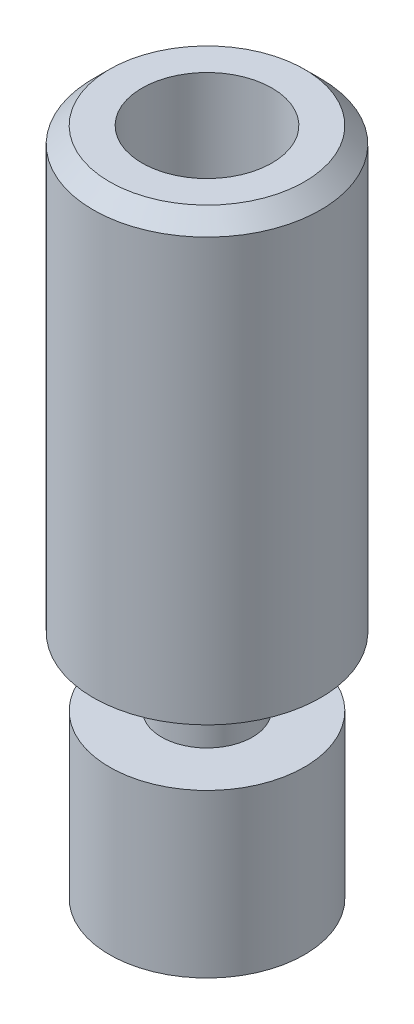
ISO-10303-21;
HEADER;
FILE_DESCRIPTION(('STEP AP214'),'2;1');
FILE_NAME('part.step','',(''),(''),'','','');
FILE_SCHEMA(('AUTOMOTIVE_DESIGN { 1 0 10303 214 1 1 1 1 }'));
ENDSEC;
DATA;
#1=APPLICATION_CONTEXT('core data for automotive mechanical design processes');
#2=APPLICATION_PROTOCOL_DEFINITION('international standard','automotive_design',2000,#1);
#3=PRODUCT_CONTEXT('',#1,'mechanical');
#4=PRODUCT('Part','Part','',(#3));
#5=PRODUCT_RELATED_PRODUCT_CATEGORY('part','',(#4));
#6=PRODUCT_DEFINITION_FORMATION('','',#4);
#7=PRODUCT_DEFINITION_CONTEXT('part definition',#1,'design');
#8=PRODUCT_DEFINITION('design','',#6,#7);
#9=PRODUCT_DEFINITION_SHAPE('','',#8);
#10=(LENGTH_UNIT() NAMED_UNIT(*) SI_UNIT(.MILLI.,.METRE.));
#11=(NAMED_UNIT(*) PLANE_ANGLE_UNIT() SI_UNIT($,.RADIAN.));
#12=(NAMED_UNIT(*) SI_UNIT($,.STERADIAN.) SOLID_ANGLE_UNIT());
#13=UNCERTAINTY_MEASURE_WITH_UNIT(LENGTH_MEASURE(1.E-05),#10,'distance_accuracy_value','');
#14=(GEOMETRIC_REPRESENTATION_CONTEXT(3) GLOBAL_UNCERTAINTY_ASSIGNED_CONTEXT((#13)) GLOBAL_UNIT_ASSIGNED_CONTEXT((#10,
#11,#12)) REPRESENTATION_CONTEXT('',''));
#15=CARTESIAN_POINT('',(0.,0.,0.));
#16=DIRECTION('',(0.,0.,1.));
#17=DIRECTION('',(1.,0.,0.));
#18=AXIS2_PLACEMENT_3D('',#15,#16,#17);
#19=CARTESIAN_POINT('',(0.,-10.3,0.));
#20=DIRECTION('',(0.,-1.,0.));
#21=DIRECTION('',(0.,0.,-1.));
#22=AXIS2_PLACEMENT_3D('',#19,#20,#21);
#23=CYLINDRICAL_SURFACE('',#22,3.);
#24=CARTESIAN_POINT('',(0.,-5.3,0.));
#25=DIRECTION('',(0.,-1.,0.));
#26=DIRECTION('',(0.,0.,-1.));
#27=AXIS2_PLACEMENT_3D('',#24,#25,#26);
#28=CIRCLE('',#27,3.);
#29=CARTESIAN_POINT('',(0.,-5.3,-3.));
#30=VERTEX_POINT('',#29);
#31=EDGE_CURVE('E42',#30,#30,#28,.T.);
#32=ORIENTED_EDGE('',*,*,#31,.T.);
#33=EDGE_LOOP('',(#32));
#34=FACE_BOUND('',#33,.T.);
#35=CARTESIAN_POINT('',(0.,-10.3,0.));
#36=DIRECTION('',(0.,-1.,0.));
#37=DIRECTION('',(0.,0.,-1.));
#38=AXIS2_PLACEMENT_3D('',#35,#36,#37);
#39=CIRCLE('',#38,3.);
#40=CARTESIAN_POINT('',(0.,-10.3,-3.));
#41=VERTEX_POINT('',#40);
#42=EDGE_CURVE('E69',#41,#41,#39,.T.);
#43=ORIENTED_EDGE('',*,*,#42,.F.);
#44=EDGE_LOOP('',(#43));
#45=FACE_BOUND('',#44,.T.);
#46=ADVANCED_FACE('F31',(#34,#45),#23,.T.);
#47=CARTESIAN_POINT('',(3.,-5.3,0.));
#48=DIRECTION('',(0.,1.,0.));
#49=DIRECTION('',(0.,0.,1.));
#50=AXIS2_PLACEMENT_3D('',#47,#48,#49);
#51=PLANE('',#50);
#52=CARTESIAN_POINT('',(0.,-5.3,0.));
#53=DIRECTION('',(0.,-1.,0.));
#54=DIRECTION('',(0.,0.,-1.));
#55=AXIS2_PLACEMENT_3D('',#52,#53,#54);
#56=CIRCLE('',#55,1.4);
#57=CARTESIAN_POINT('',(0.,-5.3,-1.4));
#58=VERTEX_POINT('',#57);
#59=EDGE_CURVE('E46',#58,#58,#56,.T.);
#60=ORIENTED_EDGE('',*,*,#59,.T.);
#61=EDGE_LOOP('',(#60));
#62=FACE_BOUND('',#61,.T.);
#63=ORIENTED_EDGE('',*,*,#31,.F.);
#64=EDGE_LOOP('',(#63));
#65=FACE_BOUND('',#64,.T.);
#66=ADVANCED_FACE('F77',(#62,#65),#51,.T.);
#67=CARTESIAN_POINT('',(0.,-10.3,0.));
#68=DIRECTION('',(0.,-1.,0.));
#69=DIRECTION('',(0.,0.,-1.));
#70=AXIS2_PLACEMENT_3D('',#67,#68,#69);
#71=CYLINDRICAL_SURFACE('',#70,1.4);
#72=CARTESIAN_POINT('',(0.,-3.2,0.));
#73=DIRECTION('',(0.,-1.,0.));
#74=DIRECTION('',(0.,0.,-1.));
#75=AXIS2_PLACEMENT_3D('',#72,#73,#74);
#76=CIRCLE('',#75,1.4);
#77=CARTESIAN_POINT('',(0.,-3.2,-1.4));
#78=VERTEX_POINT('',#77);
#79=EDGE_CURVE('E51',#78,#78,#76,.T.);
#80=ORIENTED_EDGE('',*,*,#79,.T.);
#81=EDGE_LOOP('',(#80));
#82=FACE_BOUND('',#81,.T.);
#83=ORIENTED_EDGE('',*,*,#59,.F.);
#84=EDGE_LOOP('',(#83));
#85=FACE_BOUND('',#84,.T.);
#86=ADVANCED_FACE('F82',(#82,#85),#71,.T.);
#87=CARTESIAN_POINT('',(1.4,-3.2,0.));
#88=DIRECTION('',(0.,-1.,0.));
#89=DIRECTION('',(0.,0.,-1.));
#90=AXIS2_PLACEMENT_3D('',#87,#88,#89);
#91=PLANE('',#90);
#92=CARTESIAN_POINT('',(0.,-3.2,0.));
#93=DIRECTION('',(0.,-1.,0.));
#94=DIRECTION('',(0.,0.,-1.));
#95=AXIS2_PLACEMENT_3D('',#92,#93,#94);
#96=CIRCLE('',#95,3.5);
#97=CARTESIAN_POINT('',(0.,-3.2,-3.5));
#98=VERTEX_POINT('',#97);
#99=EDGE_CURVE('E54',#98,#98,#96,.T.);
#100=ORIENTED_EDGE('',*,*,#99,.T.);
#101=EDGE_LOOP('',(#100));
#102=FACE_BOUND('',#101,.T.);
#103=ORIENTED_EDGE('',*,*,#79,.F.);
#104=EDGE_LOOP('',(#103));
#105=FACE_BOUND('',#104,.T.);
#106=ADVANCED_FACE('F88',(#102,#105),#91,.T.);
#107=CARTESIAN_POINT('',(0.,-10.3,0.));
#108=DIRECTION('',(0.,-1.,0.));
#109=DIRECTION('',(0.,0.,-1.));
#110=AXIS2_PLACEMENT_3D('',#107,#108,#109);
#111=CYLINDRICAL_SURFACE('',#110,3.5);
#112=CARTESIAN_POINT('',(0.,9.79999999999999,0.));
#113=DIRECTION('',(0.,1.,0.));
#114=DIRECTION('',(0.,0.,1.));
#115=AXIS2_PLACEMENT_3D('',#112,#113,#114);
#116=CIRCLE('',#115,3.5);
#117=CARTESIAN_POINT('',(0.,9.79999999999999,3.5));
#118=VERTEX_POINT('',#117);
#119=EDGE_CURVE('E38',#118,#118,#116,.F.);
#120=ORIENTED_EDGE('',*,*,#119,.T.);
#121=EDGE_LOOP('',(#120));
#122=FACE_BOUND('',#121,.T.);
#123=ORIENTED_EDGE('',*,*,#99,.F.);
#124=EDGE_LOOP('',(#123));
#125=FACE_BOUND('',#124,.T.);
#126=ADVANCED_FACE('F92',(#122,#125),#111,.T.);
#127=CARTESIAN_POINT('',(3.5,10.3,0.));
#128=DIRECTION('',(0.,1.,0.));
#129=DIRECTION('',(0.,0.,1.));
#130=AXIS2_PLACEMENT_3D('',#127,#128,#129);
#131=PLANE('',#130);
#132=CARTESIAN_POINT('',(0.,10.3,0.));
#133=DIRECTION('',(0.,1.,0.));
#134=DIRECTION('',(0.,0.,1.));
#135=AXIS2_PLACEMENT_3D('',#132,#133,#134);
#136=CIRCLE('',#135,2.99999999999999);
#137=CARTESIAN_POINT('',(0.,10.3,2.99999999999999));
#138=VERTEX_POINT('',#137);
#139=EDGE_CURVE('E10',#138,#138,#136,.T.);
#140=ORIENTED_EDGE('',*,*,#139,.T.);
#141=EDGE_LOOP('',(#140));
#142=FACE_BOUND('',#141,.T.);
#143=CARTESIAN_POINT('',(0.,10.3,0.));
#144=DIRECTION('',(0.,-1.,0.));
#145=DIRECTION('',(0.,0.,-1.));
#146=AXIS2_PLACEMENT_3D('',#143,#144,#145);
#147=CIRCLE('',#146,2.);
#148=CARTESIAN_POINT('',(0.,10.3,-2.));
#149=VERTEX_POINT('',#148);
#150=EDGE_CURVE('E57',#149,#149,#147,.T.);
#151=ORIENTED_EDGE('',*,*,#150,.T.);
#152=EDGE_LOOP('',(#151));
#153=FACE_BOUND('',#152,.T.);
#154=ADVANCED_FACE('F96',(#142,#153),#131,.T.);
#155=CARTESIAN_POINT('',(0.,-10.3,0.));
#156=DIRECTION('',(0.,-1.,0.));
#157=DIRECTION('',(0.,0.,-1.));
#158=AXIS2_PLACEMENT_3D('',#155,#156,#157);
#159=CYLINDRICAL_SURFACE('',#158,2.);
#160=CARTESIAN_POINT('',(0.,6.3,0.));
#161=DIRECTION('',(0.,-1.,0.));
#162=DIRECTION('',(0.,0.,-1.));
#163=AXIS2_PLACEMENT_3D('',#160,#161,#162);
#164=CIRCLE('',#163,2.);
#165=CARTESIAN_POINT('',(0.,6.3,-2.));
#166=VERTEX_POINT('',#165);
#167=EDGE_CURVE('E60',#166,#166,#164,.T.);
#168=ORIENTED_EDGE('',*,*,#167,.T.);
#169=EDGE_LOOP('',(#168));
#170=FACE_BOUND('',#169,.T.);
#171=ORIENTED_EDGE('',*,*,#150,.F.);
#172=EDGE_LOOP('',(#171));
#173=FACE_BOUND('',#172,.T.);
#174=ADVANCED_FACE('F99',(#170,#173),#159,.F.);
#175=CARTESIAN_POINT('',(0.,6.3,0.));
#176=DIRECTION('',(0.,1.,0.));
#177=DIRECTION('',(0.,0.,1.));
#178=AXIS2_PLACEMENT_3D('',#175,#176,#177);
#179=CONICAL_SURFACE('',#178,2.,1.0471975511966);
#180=CARTESIAN_POINT('',(0.,5.72264973081038,0.));
#181=DIRECTION('',(0.,-1.,0.));
#182=DIRECTION('',(0.,0.,-1.));
#183=AXIS2_PLACEMENT_3D('',#180,#181,#182);
#184=CIRCLE('',#183,1.);
#185=CARTESIAN_POINT('',(0.,5.72264973081038,-1.));
#186=VERTEX_POINT('',#185);
#187=EDGE_CURVE('E63',#186,#186,#184,.T.);
#188=ORIENTED_EDGE('',*,*,#187,.T.);
#189=EDGE_LOOP('',(#188));
#190=FACE_BOUND('',#189,.T.);
#191=ORIENTED_EDGE('',*,*,#167,.F.);
#192=EDGE_LOOP('',(#191));
#193=FACE_BOUND('',#192,.T.);
#194=ADVANCED_FACE('F102',(#190,#193),#179,.F.);
#195=CARTESIAN_POINT('',(0.,-10.3,0.));
#196=DIRECTION('',(0.,-1.,0.));
#197=DIRECTION('',(0.,0.,-1.));
#198=AXIS2_PLACEMENT_3D('',#195,#196,#197);
#199=CYLINDRICAL_SURFACE('',#198,1.);
#200=CARTESIAN_POINT('',(0.,-10.3,0.));
#201=DIRECTION('',(0.,-1.,0.));
#202=DIRECTION('',(0.,0.,-1.));
#203=AXIS2_PLACEMENT_3D('',#200,#201,#202);
#204=CIRCLE('',#203,1.);
#205=CARTESIAN_POINT('',(0.,-10.3,-1.));
#206=VERTEX_POINT('',#205);
#207=EDGE_CURVE('E66',#206,#206,#204,.T.);
#208=ORIENTED_EDGE('',*,*,#207,.T.);
#209=EDGE_LOOP('',(#208));
#210=FACE_BOUND('',#209,.T.);
#211=ORIENTED_EDGE('',*,*,#187,.F.);
#212=EDGE_LOOP('',(#211));
#213=FACE_BOUND('',#212,.T.);
#214=ADVANCED_FACE('F106',(#210,#213),#199,.F.);
#215=CARTESIAN_POINT('',(1.,-10.3,0.));
#216=DIRECTION('',(0.,-1.,0.));
#217=DIRECTION('',(0.,0.,-1.));
#218=AXIS2_PLACEMENT_3D('',#215,#216,#217);
#219=PLANE('',#218);
#220=ORIENTED_EDGE('',*,*,#42,.T.);
#221=EDGE_LOOP('',(#220));
#222=FACE_BOUND('',#221,.T.);
#223=ORIENTED_EDGE('',*,*,#207,.F.);
#224=EDGE_LOOP('',(#223));
#225=FACE_BOUND('',#224,.T.);
#226=ADVANCED_FACE('F73',(#222,#225),#219,.T.);
#227=CARTESIAN_POINT('',(0.,9.79999999999999,0.));
#228=DIRECTION('',(0.,-1.,0.));
#229=DIRECTION('',(0.,0.,-1.));
#230=AXIS2_PLACEMENT_3D('',#227,#228,#229);
#231=CONICAL_SURFACE('',#230,3.5,0.785398163397449);
#232=ORIENTED_EDGE('',*,*,#139,.F.);
#233=EDGE_LOOP('',(#232));
#234=FACE_BOUND('',#233,.T.);
#235=ORIENTED_EDGE('',*,*,#119,.F.);
#236=EDGE_LOOP('',(#235));
#237=FACE_BOUND('',#236,.T.);
#238=ADVANCED_FACE('F33',(#234,#237),#231,.T.);
#239=CLOSED_SHELL('',(#46,#66,#86,#106,#126,#154,#174,#194,#214,#226,#238));
#240=MANIFOLD_SOLID_BREP('B2',#239);
#241=ADVANCED_BREP_SHAPE_REPRESENTATION('',(#18,#240),#14);
#242=SHAPE_DEFINITION_REPRESENTATION(#9,#241);
ENDSEC;
END-ISO-10303-21;
